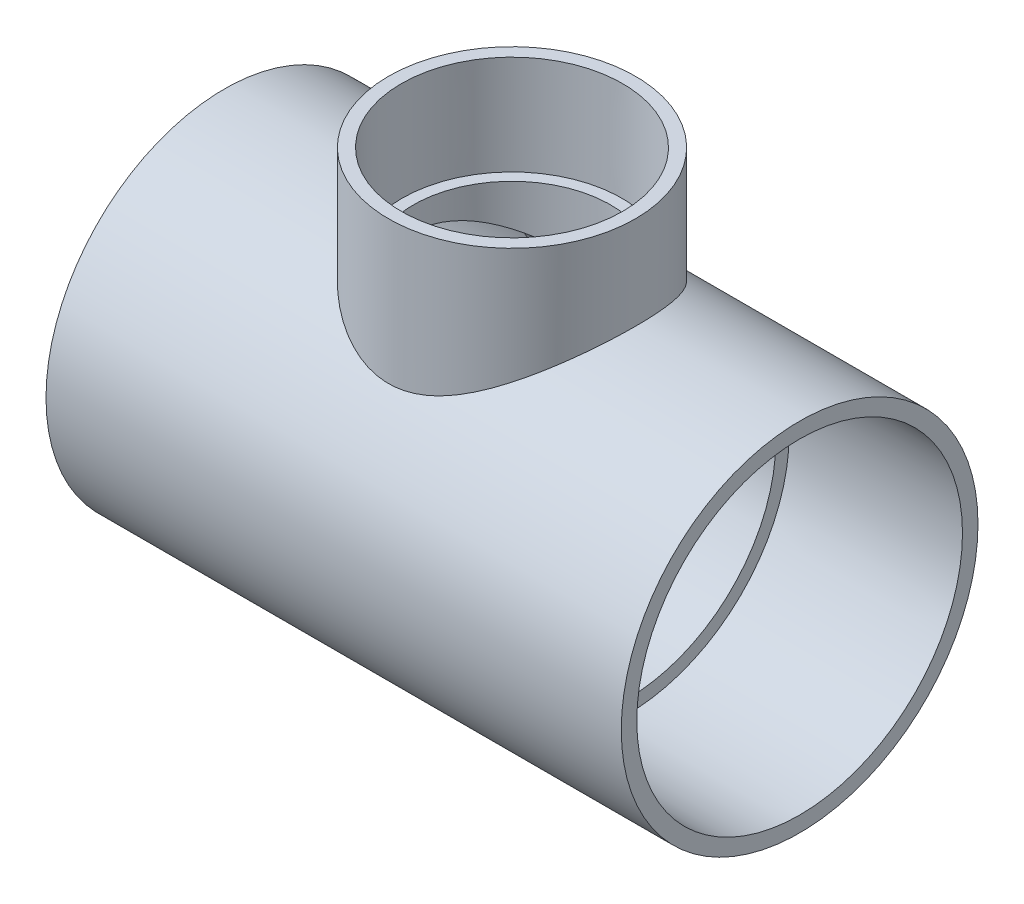
ISO-10303-21;
HEADER;
FILE_DESCRIPTION(('STEP AP214'),'2;1');
FILE_NAME('part.step','',(''),(''),'','','');
FILE_SCHEMA(('AUTOMOTIVE_DESIGN { 1 0 10303 214 1 1 1 1 }'));
ENDSEC;
DATA;
#1=APPLICATION_CONTEXT('core data for automotive mechanical design processes');
#2=APPLICATION_PROTOCOL_DEFINITION('international standard','automotive_design',2000,#1);
#3=PRODUCT_CONTEXT('',#1,'mechanical');
#4=PRODUCT('Part','Part','',(#3));
#5=PRODUCT_RELATED_PRODUCT_CATEGORY('part','',(#4));
#6=PRODUCT_DEFINITION_FORMATION('','',#4);
#7=PRODUCT_DEFINITION_CONTEXT('part definition',#1,'design');
#8=PRODUCT_DEFINITION('design','',#6,#7);
#9=PRODUCT_DEFINITION_SHAPE('','',#8);
#10=(LENGTH_UNIT() NAMED_UNIT(*) SI_UNIT(.MILLI.,.METRE.));
#11=(NAMED_UNIT(*) PLANE_ANGLE_UNIT() SI_UNIT($,.RADIAN.));
#12=(NAMED_UNIT(*) SI_UNIT($,.STERADIAN.) SOLID_ANGLE_UNIT());
#13=UNCERTAINTY_MEASURE_WITH_UNIT(LENGTH_MEASURE(1.E-05),#10,'distance_accuracy_value','');
#14=(GEOMETRIC_REPRESENTATION_CONTEXT(3) GLOBAL_UNCERTAINTY_ASSIGNED_CONTEXT((#13)) GLOBAL_UNIT_ASSIGNED_CONTEXT((#10,
#11,#12)) REPRESENTATION_CONTEXT('',''));
#15=CARTESIAN_POINT('',(0.,0.,0.));
#16=DIRECTION('',(0.,0.,1.));
#17=DIRECTION('',(1.,0.,0.));
#18=AXIS2_PLACEMENT_3D('',#15,#16,#17);
#19=CARTESIAN_POINT('',(-59.69,0.,0.));
#20=DIRECTION('',(1.,0.,0.));
#21=DIRECTION('',(0.,0.,-1.));
#22=AXIS2_PLACEMENT_3D('',#19,#20,#21);
#23=PLANE('',#22);
#24=CARTESIAN_POINT('',(-59.69,0.,0.));
#25=DIRECTION('',(-1.,0.,0.));
#26=DIRECTION('',(0.,0.,1.));
#27=AXIS2_PLACEMENT_3D('',#24,#25,#26);
#28=CIRCLE('',#27,83.9978);
#29=CARTESIAN_POINT('',(-59.69,0.,83.9978));
#30=VERTEX_POINT('',#29);
#31=EDGE_CURVE('E99',#30,#30,#28,.T.);
#32=ORIENTED_EDGE('',*,*,#31,.T.);
#33=EDGE_LOOP('',(#32));
#34=FACE_BOUND('',#33,.T.);
#35=CARTESIAN_POINT('',(-59.69,0.,0.));
#36=DIRECTION('',(1.,0.,0.));
#37=DIRECTION('',(0.,0.,-1.));
#38=AXIS2_PLACEMENT_3D('',#35,#36,#37);
#39=CIRCLE('',#38,77.0255);
#40=CARTESIAN_POINT('',(-59.69,0.,-77.0255));
#41=VERTEX_POINT('',#40);
#42=EDGE_CURVE('E102',#41,#41,#39,.T.);
#43=ORIENTED_EDGE('',*,*,#42,.T.);
#44=EDGE_LOOP('',(#43));
#45=FACE_BOUND('',#44,.T.);
#46=ADVANCED_FACE('F32',(#34,#45),#23,.F.);
#47=CARTESIAN_POINT('',(59.69,0.,0.));
#48=DIRECTION('',(1.,0.,0.));
#49=DIRECTION('',(0.,0.,-1.));
#50=AXIS2_PLACEMENT_3D('',#47,#48,#49);
#51=PLANE('',#50);
#52=CARTESIAN_POINT('',(59.69,0.,0.));
#53=DIRECTION('',(1.,0.,0.));
#54=DIRECTION('',(0.,0.,-1.));
#55=AXIS2_PLACEMENT_3D('',#52,#53,#54);
#56=CIRCLE('',#55,77.0255);
#57=CARTESIAN_POINT('',(59.69,0.,-77.0255));
#58=VERTEX_POINT('',#57);
#59=EDGE_CURVE('E105',#58,#58,#56,.T.);
#60=ORIENTED_EDGE('',*,*,#59,.F.);
#61=EDGE_LOOP('',(#60));
#62=FACE_BOUND('',#61,.T.);
#63=CARTESIAN_POINT('',(59.69,0.,0.));
#64=DIRECTION('',(1.,0.,0.));
#65=DIRECTION('',(0.,0.,-1.));
#66=AXIS2_PLACEMENT_3D('',#63,#64,#65);
#67=CIRCLE('',#66,83.9978);
#68=CARTESIAN_POINT('',(59.69,0.,-83.9978));
#69=VERTEX_POINT('',#68);
#70=EDGE_CURVE('E10',#69,#69,#67,.F.);
#71=ORIENTED_EDGE('',*,*,#70,.F.);
#72=EDGE_LOOP('',(#71));
#73=FACE_BOUND('',#72,.T.);
#74=ADVANCED_FACE('F74',(#62,#73),#51,.T.);
#75=CARTESIAN_POINT('',(59.69,0.,0.));
#76=DIRECTION('',(-1.,0.,0.));
#77=DIRECTION('',(0.,0.,1.));
#78=AXIS2_PLACEMENT_3D('',#75,#76,#77);
#79=CYLINDRICAL_SURFACE('',#78,92.456);
#80=CARTESIAN_POINT('',(-149.098,0.,0.));
#81=DIRECTION('',(-1.,0.,0.));
#82=DIRECTION('',(0.,0.,1.));
#83=AXIS2_PLACEMENT_3D('',#80,#81,#82);
#84=CIRCLE('',#83,92.456);
#85=CARTESIAN_POINT('',(-149.098,0.,92.456));
#86=VERTEX_POINT('',#85);
#87=EDGE_CURVE('E116',#86,#86,#84,.T.);
#88=ORIENTED_EDGE('',*,*,#87,.F.);
#89=EDGE_LOOP('',(#88));
#90=FACE_BOUND('',#89,.T.);
#91=CARTESIAN_POINT('',(149.098,0.,0.));
#92=DIRECTION('',(-1.,0.,0.));
#93=DIRECTION('',(0.,0.,1.));
#94=AXIS2_PLACEMENT_3D('',#91,#92,#93);
#95=CIRCLE('',#94,92.456);
#96=CARTESIAN_POINT('',(149.098,0.,92.456));
#97=VERTEX_POINT('',#96);
#98=EDGE_CURVE('E104',#97,#97,#95,.T.);
#99=ORIENTED_EDGE('',*,*,#98,.T.);
#100=EDGE_LOOP('',(#99));
#101=FACE_BOUND('',#100,.T.);
#102=CARTESIAN_POINT('',(59.69,89.5208577483482,-23.1112086226575));
#103=CARTESIAN_POINT('',(59.3554663387617,89.2977999864228,-23.9752190458187));
#104=CARTESIAN_POINT('',(59.0031074123157,89.0638956499389,-24.8295390852443));
#105=CARTESIAN_POINT('',(58.26403555565,88.5760050139357,-26.5174514416343));
#106=CARTESIAN_POINT('',(57.8773176495958,88.3220158063324,-27.351040733946));
#107=CARTESIAN_POINT('',(57.0706194898345,87.7955010413279,-28.9967010459885));
#108=CARTESIAN_POINT('',(56.6506178591822,87.5229635871771,-29.8087577819716));
#109=CARTESIAN_POINT('',(55.7788572080423,86.9612430102109,-31.4097801961228));
#110=CARTESIAN_POINT('',(55.3270943985306,86.6720579021228,-32.198743103303));
#111=CARTESIAN_POINT('',(53.9229938311503,85.7802556376608,-34.5346499151826));
#112=CARTESIAN_POINT('',(52.9243438206633,85.1550349066213,-36.0455299595556));
#113=CARTESIAN_POINT('',(50.813858099626,83.8596568386321,-38.9643475085655));
#114=CARTESIAN_POINT('',(49.7020451482914,83.1895085466855,-40.3723056152713));
#115=CARTESIAN_POINT('',(47.3806832688408,81.8238472929828,-43.072527990592));
#116=CARTESIAN_POINT('',(46.1718653514752,81.1285423858296,-44.3655266603224));
#117=CARTESIAN_POINT('',(43.655809691159,79.7234476283726,-46.8434918221617));
#118=CARTESIAN_POINT('',(42.3485638201298,79.0136565853544,-48.0284493744432));
#119=CARTESIAN_POINT('',(39.6411181758483,77.5962391482218,-50.2862916521847));
#120=CARTESIAN_POINT('',(38.2409757736595,76.8886116952772,-51.3592445149715));
#121=CARTESIAN_POINT('',(35.3505043579797,75.4926779572051,-53.3899335636718));
#122=CARTESIAN_POINT('',(33.8601867618232,74.8043692421651,-54.3476842899613));
#123=CARTESIAN_POINT('',(30.984331803503,73.5503846340758,-56.0304578391637));
#124=CARTESIAN_POINT('',(29.6090438539686,72.9801456957546,-56.7696052260947));
#125=CARTESIAN_POINT('',(26.7935782985449,71.8839536313517,-58.1514131749876));
#126=CARTESIAN_POINT('',(25.3534008887046,71.3580003714844,-58.7940740284365));
#127=CARTESIAN_POINT('',(22.4134119857637,70.3671558115938,-59.9764098853398));
#128=CARTESIAN_POINT('',(20.9136868170345,69.9021800426788,-60.5162278314716));
#129=CARTESIAN_POINT('',(17.8580526442485,69.0496075231491,-61.4872494797449));
#130=CARTESIAN_POINT('',(16.3021573262223,68.6619920717214,-61.9184794381799));
#131=CARTESIAN_POINT('',(13.4403927328667,68.0453102055292,-62.5948544851815));
#132=CARTESIAN_POINT('',(12.1426495834532,67.8001311985442,-62.8597520112977));
#133=CARTESIAN_POINT('',(9.52212873223079,67.3801710178434,-63.3097119517935));
#134=CARTESIAN_POINT('',(8.19935418177174,67.2053810433653,-63.4947843469392));
#135=CARTESIAN_POINT('',(5.53822260526522,66.932877858907,-63.7819819623347));
#136=CARTESIAN_POINT('',(4.19988251370853,66.8350876238845,-63.8841900771378));
#137=CARTESIAN_POINT('',(1.51589744611891,66.72022536874,-64.0041444786235));
#138=CARTESIAN_POINT('',(0.170252368713385,66.7031544716561,-64.0218895901827));
#139=CARTESIAN_POINT('',(-2.51875979197083,66.750459096728,-63.9725664205185));
#140=CARTESIAN_POINT('',(-3.86212523769395,66.8148789330069,-63.9054519932469));
#141=CARTESIAN_POINT('',(-6.53580579486743,67.0225913724504,-63.6875700974569));
#142=CARTESIAN_POINT('',(-7.86612098407086,67.165883505405,-63.5368031276466));
#143=CARTESIAN_POINT('',(-10.5064594434597,67.5259989366212,-63.1539406048978));
#144=CARTESIAN_POINT('',(-11.8164563008452,67.7429107233929,-62.9217471686863));
#145=CARTESIAN_POINT('',(-14.4074136415402,68.242540125223,-62.3795094150518));
#146=CARTESIAN_POINT('',(-15.6883702354653,68.5252664984066,-62.0694547359896));
#147=CARTESIAN_POINT('',(-18.590264837853,69.2399138788802,-61.2724353166537));
#148=CARTESIAN_POINT('',(-20.1995407728231,69.6912223453109,-60.7602719764554));
#149=CARTESIAN_POINT('',(-23.3525227788316,70.669504803955,-59.6196018302944));
#150=CARTESIAN_POINT('',(-24.8962081753497,71.1965024278969,-58.9910586703413));
#151=CARTESIAN_POINT('',(-27.9152323941623,72.3075035741706,-57.623897515403));
#152=CARTESIAN_POINT('',(-29.3904751438177,72.8915838536071,-56.8851305837498));
#153=CARTESIAN_POINT('',(-32.2674158074538,74.0983716021366,-55.3039987445553));
#154=CARTESIAN_POINT('',(-33.6691188976241,74.7210763458429,-54.4616411423792));
#155=CARTESIAN_POINT('',(-36.4280838800247,76.0037343697505,-52.6573571852428));
#156=CARTESIAN_POINT('',(-37.7836014823566,76.6642134029718,-51.6931407803076));
#157=CARTESIAN_POINT('',(-40.4130587434385,77.9936967036142,-49.6645357200113));
#158=CARTESIAN_POINT('',(-41.686995701166,78.6627012524252,-48.6001437508541));
#159=CARTESIAN_POINT('',(-44.1493131272083,79.9948652255017,-46.3747178899279));
#160=CARTESIAN_POINT('',(-45.3377396044791,80.6580276219993,-45.2137367042097));
#161=CARTESIAN_POINT('',(-47.6254436970386,81.9657865552406,-42.7973012767197));
#162=CARTESIAN_POINT('',(-48.7247249469364,82.6103838482248,-41.5418508906527));
#163=CARTESIAN_POINT('',(-50.7995845338728,83.8511405580784,-38.9752915638771));
#164=CARTESIAN_POINT('',(-51.7777420116761,84.4481463063878,-37.6666797734471));
#165=CARTESIAN_POINT('',(-53.6384817153447,85.6016455572665,-34.9660678761339));
#166=CARTESIAN_POINT('',(-54.5210629005335,86.1581386186942,-33.5740668615287));
#167=CARTESIAN_POINT('',(-56.1830797984639,87.2193648196669,-30.7119273073396));
#168=CARTESIAN_POINT('',(-56.9625708389603,87.7241256905067,-29.2418312795231));
#169=CARTESIAN_POINT('',(-58.4111151201601,88.6715627483233,-26.2289614358095));
#170=CARTESIAN_POINT('',(-59.0801819837558,89.1142465926504,-24.6861966152013));
#171=CARTESIAN_POINT('',(-60.2259582414038,89.8782210832087,-21.72697960313));
#172=CARTESIAN_POINT('',(-60.7161506561855,90.2077206453983,-20.3178603086698));
#173=CARTESIAN_POINT('',(-61.599729753784,90.804781929651,-17.4567562430098));
#174=CARTESIAN_POINT('',(-61.9931238874162,91.0723484187696,-16.004774780664));
#175=CARTESIAN_POINT('',(-62.6781740613817,91.5400389492652,-13.0669249337033));
#176=CARTESIAN_POINT('',(-62.9698727684976,91.7401912733666,-11.5810710398642));
#177=CARTESIAN_POINT('',(-63.4478550829534,92.0689309244302,-8.5846012989107));
#178=CARTESIAN_POINT('',(-63.6341377365908,92.1975176039354,-7.07398522789925));
#179=CARTESIAN_POINT('',(-63.8989529709849,92.3804895182398,-4.03488714552636));
#180=CARTESIAN_POINT('',(-63.9772062451495,92.434682408195,-2.50636908868671));
#181=CARTESIAN_POINT('',(-64.0238922256719,92.467001461198,0.553154747373212));
#182=CARTESIAN_POINT('',(-63.9923249101024,92.4451276090579,2.08416052709014));
#183=CARTESIAN_POINT('',(-63.8198363375468,92.3258118024288,5.13717545831421));
#184=CARTESIAN_POINT('',(-63.6789031187684,92.2283615818465,6.65918360736484));
#185=CARTESIAN_POINT('',(-63.2897360531864,91.9600930541029,9.68281513276673));
#186=CARTESIAN_POINT('',(-63.0415027881938,91.7892751447618,11.1844386196038));
#187=CARTESIAN_POINT('',(-62.4492163769531,91.3835177173027,14.1172861666169));
#188=CARTESIAN_POINT('',(-62.1078972337637,91.1504111134797,15.5493195200951));
#189=CARTESIAN_POINT('',(-61.3310534151464,90.6228708211983,18.3759176742353));
#190=CARTESIAN_POINT('',(-60.8955309098098,90.3284385454585,19.7704833371801));
#191=CARTESIAN_POINT('',(-59.9349862860816,89.6836870842967,22.5152396738962));
#192=CARTESIAN_POINT('',(-59.4099538066725,89.3333614293689,23.865425188942));
#193=CARTESIAN_POINT('',(-58.2754664792542,88.5829380934113,26.5155048160386));
#194=CARTESIAN_POINT('',(-57.6660069899738,88.1828376761983,27.8153961581997));
#195=CARTESIAN_POINT('',(-56.3067971239888,87.2997808145201,30.4796647849184));
#196=CARTESIAN_POINT('',(-55.5492497658111,86.8125727375233,31.8386539110354));
#197=CARTESIAN_POINT('',(-53.945477302325,85.7952102379854,34.4863112252674));
#198=CARTESIAN_POINT('',(-53.0992475416272,85.2650535611861,35.7749757162797));
#199=CARTESIAN_POINT('',(-51.3231691004812,84.1704580204781,38.2794310396203));
#200=CARTESIAN_POINT('',(-50.3932608277157,83.6059948192602,39.4951688932246));
#201=CARTESIAN_POINT('',(-48.4552781427792,82.4523839052352,41.8501604099012));
#202=CARTESIAN_POINT('',(-47.4471997210683,81.863234926947,42.9894101441094));
#203=CARTESIAN_POINT('',(-45.1748165015013,80.5657241684703,45.3809939226213));
#204=CARTESIAN_POINT('',(-43.8964690564179,79.8544747103552,46.6184523982376));
#205=CARTESIAN_POINT('',(-41.2427378202998,78.4270341135425,48.9818180440883));
#206=CARTESIAN_POINT('',(-39.8673372707892,77.7108421407618,50.1077058679584));
#207=CARTESIAN_POINT('',(-37.0230871554459,76.2907450461675,52.2444259513123));
#208=CARTESIAN_POINT('',(-35.5542086612206,75.5868438146674,53.2552223211456));
#209=CARTESIAN_POINT('',(-32.526588166316,74.2108410298406,55.1564991838276));
#210=CARTESIAN_POINT('',(-30.9678649299345,73.5387328894519,56.0470046707584));
#211=CARTESIAN_POINT('',(-28.0457860210703,72.3615598232684,57.555751393063));
#212=CARTESIAN_POINT('',(-26.6963645448734,71.8479215786282,58.1943226483861));
#213=CARTESIAN_POINT('',(-23.9407699143416,70.8702302952243,59.3810866420334));
#214=CARTESIAN_POINT('',(-22.5345990520069,70.4061752566445,59.9292830258894));
#215=CARTESIAN_POINT('',(-19.6717151349019,69.5428313049946,60.9289947473117));
#216=CARTESIAN_POINT('',(-18.2150934238472,69.1434320806358,61.3806751843003));
#217=CARTESIAN_POINT('',(-15.2550875291832,68.4232953662764,62.1824392291871));
#218=CARTESIAN_POINT('',(-13.7517122891122,68.1025429348691,62.5325421372192));
#219=CARTESIAN_POINT('',(-10.9430674509587,67.5961308388841,63.0792472426034));
#220=CARTESIAN_POINT('',(-9.64316924053322,67.3972433184131,63.2912239615251));
#221=CARTESIAN_POINT('',(-7.02377566323692,67.0725991759373,63.6351688956575));
#222=CARTESIAN_POINT('',(-5.70428250154615,66.9468343878434,63.7671460450082));
#223=CARTESIAN_POINT('',(-3.055330889708,66.7733298123732,63.948810006117));
#224=CARTESIAN_POINT('',(-1.72587932061167,66.7255403891269,63.9985491674223));
#225=CARTESIAN_POINT('',(0.934053289756203,66.7097565771038,64.0150019415726));
#226=CARTESIAN_POINT('',(2.26453435474056,66.741764084538,63.9817135814382));
#227=CARTESIAN_POINT('',(4.91479822330304,66.8841851245378,63.8328139280837));
#228=CARTESIAN_POINT('',(6.23459301370627,66.9944930930691,63.7173134719547));
#229=CARTESIAN_POINT('',(8.85621355716845,67.2891020758207,63.4061061368734));
#230=CARTESIAN_POINT('',(10.1580394250519,67.4734026169891,63.2103997706961));
#231=CARTESIAN_POINT('',(12.7376700944918,67.9096280729765,62.7415067036277));
#232=CARTESIAN_POINT('',(14.0154444255436,68.1616333036571,62.4682279592413));
#233=CARTESIAN_POINT('',(16.5395465442369,68.7250313532904,61.8478562094793));
#234=CARTESIAN_POINT('',(17.7858699763579,69.036432347194,61.500753042503));
#235=CARTESIAN_POINT('',(20.683814684731,69.830728845329,60.5991755011647));
#236=CARTESIAN_POINT('',(22.3203729892869,70.3350638559387,60.0149845268321));
#237=CARTESIAN_POINT('',(25.5207011970825,71.4151384908384,58.7256061669105));
#238=CARTESIAN_POINT('',(27.0844451623909,71.9909032962532,58.0203760776508));
#239=CARTESIAN_POINT('',(30.1370734696571,73.1939915044692,56.4950991527124));
#240=CARTESIAN_POINT('',(31.6258466908258,73.8213880082653,55.6748883290961));
#241=CARTESIAN_POINT('',(34.523302593221,75.1083317905249,53.926144079416));
#242=CARTESIAN_POINT('',(35.9319922407525,75.7678762632038,52.9976200968012));
#243=CARTESIAN_POINT('',(38.6976703845909,77.1174968776912,51.0144519498477));
#244=CARTESIAN_POINT('',(40.0527933785384,77.8079260007436,49.9574481682455));
#245=CARTESIAN_POINT('',(42.673777691236,79.1890072465014,47.7380517027536));
#246=CARTESIAN_POINT('',(43.9396352614759,79.8796593773495,46.5756545977767));
#247=CARTESIAN_POINT('',(46.3768218174502,81.2458007656194,44.1493906691446));
#248=CARTESIAN_POINT('',(47.5482210054017,81.9213010094225,42.885600621487));
#249=CARTESIAN_POINT('',(49.7918820326032,83.2436079374658,40.258855577447));
#250=CARTESIAN_POINT('',(50.8641503916193,83.8904165072799,38.895907113196));
#251=CARTESIAN_POINT('',(52.8407877277969,85.1038533788474,36.1600270419427));
#252=CARTESIAN_POINT('',(53.7513945981831,85.6729653351185,34.7927100229949));
#253=CARTESIAN_POINT('',(55.4721462820419,86.7629165758382,31.9779000804274));
#254=CARTESIAN_POINT('',(56.2822948320487,87.2837576555337,30.5304101417281));
#255=CARTESIAN_POINT('',(57.7944478299843,88.2663910326196,27.5608373976906));
#256=CARTESIAN_POINT('',(58.4964809819213,88.7281989974051,26.0387745329751));
#257=CARTESIAN_POINT('',(59.4623706299638,89.3689190030956,23.7056943386896));
#258=CARTESIAN_POINT('',(59.7698460562192,89.5738533851768,22.9195504068006));
#259=CARTESIAN_POINT('',(60.354777972653,89.9652141909304,21.3316750902643));
#260=CARTESIAN_POINT('',(60.6322378338672,90.1516426927964,20.5299454679956));
#261=CARTESIAN_POINT('',(61.1581262613215,90.5061671927235,18.9061231863044));
#262=CARTESIAN_POINT('',(61.406322660074,90.6741159579108,18.0839231974439));
#263=CARTESIAN_POINT('',(61.8702927369785,90.9889661247029,16.4265440881315));
#264=CARTESIAN_POINT('',(62.0860703424854,91.1358700756682,15.5913665533845));
#265=CARTESIAN_POINT('',(62.484376437842,91.4076800679971,13.9094816541103));
#266=CARTESIAN_POINT('',(62.6669016314913,91.5325839285247,13.0627731554883));
#267=CARTESIAN_POINT('',(62.9978906888644,91.7595095095671,11.3596801832324));
#268=CARTESIAN_POINT('',(63.1463546606409,91.8615313026709,10.5032957403026));
#269=CARTESIAN_POINT('',(63.4085180820853,92.0419414838107,8.78298023850757));
#270=CARTESIAN_POINT('',(63.522226801778,92.1203361736605,7.91905125528919));
#271=CARTESIAN_POINT('',(63.7144033047439,92.2529577950264,6.18542374862218));
#272=CARTESIAN_POINT('',(63.7928707992452,92.3071845285065,5.31572517795596));
#273=CARTESIAN_POINT('',(63.9141790298195,92.3910614405496,3.57278875701442));
#274=CARTESIAN_POINT('',(63.9570248057869,92.420715095802,2.69955142499016));
#275=CARTESIAN_POINT('',(64.0068977630762,92.4552351173357,0.951582206292259));
#276=CARTESIAN_POINT('',(64.0139261290647,92.4601023034336,0.076850370006871));
#277=CARTESIAN_POINT('',(63.9935261638878,92.4459801322149,-1.56037185898708));
#278=CARTESIAN_POINT('',(63.970378955807,92.429954849911,-2.32294588165685));
#279=CARTESIAN_POINT('',(63.8968866373954,92.3791063410444,-3.84622308353524));
#280=CARTESIAN_POINT('',(63.8465391949756,92.3442815026489,-4.6069260967089));
#281=CARTESIAN_POINT('',(63.7188305582862,92.2560301121719,-6.1249281571982));
#282=CARTESIAN_POINT('',(63.6414713808815,92.2026049489077,-6.88222745438171));
#283=CARTESIAN_POINT('',(63.4600257621432,92.0774592577576,-8.39211966925378));
#284=CARTESIAN_POINT('',(63.355936833218,92.0057370270678,-9.14471214222278));
#285=CARTESIAN_POINT('',(63.0044798939429,91.7639520797472,-11.3909022501));
#286=CARTESIAN_POINT('',(62.7176851838194,91.5671067016522,-12.8757042651209));
#287=CARTESIAN_POINT('',(62.0428437349938,91.10621117485,-15.8106457961657));
#288=CARTESIAN_POINT('',(61.6548403170305,90.8421897809276,-17.2607998534852));
#289=CARTESIAN_POINT('',(60.9898707385302,90.3926105113727,-19.4389894643457));
#290=CARTESIAN_POINT('',(60.747814528654,90.2294254845745,-20.1825618413042));
#291=CARTESIAN_POINT('',(60.238001800017,89.8869792120305,-21.6567558345627));
#292=CARTESIAN_POINT('',(59.9702560292323,89.7077246914692,-22.3873827167257));
#293=CARTESIAN_POINT('',(59.69,89.5208577483482,-23.1112086226575));
#294=B_SPLINE_CURVE_WITH_KNOTS('',3,(#102,#103,#104,#105,#106,#107,#108,#109,#110,#111,#112,
#113,#114,#115,#116,#117,#118,#119,#120,#121,#122,#123,#124,#125,#126,#127,#128,#129,#130,#131,
#132,#133,#134,#135,#136,#137,#138,#139,#140,#141,#142,#143,#144,#145,#146,#147,#148,#149,#150,
#151,#152,#153,#154,#155,#156,#157,#158,#159,#160,#161,#162,#163,#164,#165,#166,#167,#168,#169,
#170,#171,#172,#173,#174,#175,#176,#177,#178,#179,#180,#181,#182,#183,#184,#185,#186,#187,#188,
#189,#190,#191,#192,#193,#194,#195,#196,#197,#198,#199,#200,#201,#202,#203,#204,#205,#206,#207,
#208,#209,#210,#211,#212,#213,#214,#215,#216,#217,#218,#219,#220,#221,#222,#223,#224,#225,#226,
#227,#228,#229,#230,#231,#232,#233,#234,#235,#236,#237,#238,#239,#240,#241,#242,#243,#244,#245,
#246,#247,#248,#249,#250,#251,#252,#253,#254,#255,#256,#257,#258,#259,#260,#261,#262,#263,#264,
#265,#266,#267,#268,#269,#270,#271,#272,#273,#274,#275,#276,#277,#278,#279,#280,#281,#282,#283,
#284,#285,#286,#287,#288,#289,#290,#291,#292,#293),.UNSPECIFIED.,.T.,.F.,(4,2,2,2,2,2,2,2,2,2,2,
2,2,2,2,2,2,2,2,2,2,2,2,2,2,2,2,2,2,2,2,2,2,2,2,2,2,2,2,2,2,2,2,2,2,2,2,2,2,2,2,2,2,2,2,2,2,2,2,
2,2,2,2,2,2,2,2,2,2,2,2,2,2,2,2,2,2,2,2,2,2,2,2,2,2,2,2,2,2,2,2,2,2,2,2,4),(0.,2.85871127809711,
5.71783722892731,8.57881461295993,11.4401338850378,17.1804021320638,22.9195181748721,
28.6188466365329,34.318646260117,40.0149579888676,45.7105499946817,50.6929030230498,
55.6752409993694,60.6506026142082,65.6247600418299,69.6617091014858,73.6981532633452,
77.7305545067021,81.7630118521949,85.7976629643336,89.8322900235102,93.8717838536415,
97.9118155377489,103.14831706495,108.386457105391,113.631740228364,118.87665365821,
124.24126576111,129.606055387176,134.967936559517,140.329599008414,145.543081317949,
150.756620388456,155.967349935162,161.177436159395,165.756488558504,170.335188385713,
174.911964880047,179.488782779969,184.07741187741,188.666041891039,193.255173852489,
197.844280930688,202.310915682658,206.777447551122,211.244496783997,215.711791684943,
220.59811695125,225.484698854183,230.374788740877,235.26512961848,241.007429783981,
246.750723929056,252.495804162845,258.239688839625,262.972066804978,267.704253829453,
272.428280035689,277.151408069492,281.143171570156,285.134489199077,289.123265128797,
293.112135844529,297.095638986787,301.079116661982,305.067340832655,309.056114320184,
314.476347995163,319.898497922373,325.328461235073,330.757951481429,336.309089379534,
341.860460247132,347.407666518396,352.954507693797,358.165071875611,363.375442192988,
368.584426793729,371.189687155741,373.794654617603,376.419067147024,379.043161486805,
381.667515802924,384.291861793663,386.915507198923,389.539174102334,392.162469736312,
394.785678603806,397.074255751157,399.363029147284,401.651631685829,403.94044728932,
408.509686725154,413.076973572709,415.472860884299,417.867750141648),.UNSPECIFIED.);
#295=CARTESIAN_POINT('',(59.69,89.5208577483482,-23.1112086226575));
#296=VERTEX_POINT('',#295);
#297=EDGE_CURVE('E57',#296,#296,#294,.T.);
#298=ORIENTED_EDGE('',*,*,#297,.F.);
#299=EDGE_LOOP('',(#298));
#300=FACE_BOUND('',#299,.T.);
#301=ADVANCED_FACE('F69',(#90,#101,#300),#79,.T.);
#302=CARTESIAN_POINT('',(-59.69,0.,0.));
#303=DIRECTION('',(-1.,0.,0.));
#304=DIRECTION('',(0.,0.,1.));
#305=AXIS2_PLACEMENT_3D('',#302,#303,#304);
#306=CONICAL_SURFACE('',#305,83.9978,0.00468746566817729);
#307=CARTESIAN_POINT('',(-149.098,0.,0.));
#308=DIRECTION('',(-1.,0.,0.));
#309=DIRECTION('',(0.,0.,1.));
#310=AXIS2_PLACEMENT_3D('',#307,#308,#309);
#311=CIRCLE('',#310,84.4169);
#312=CARTESIAN_POINT('',(-149.098,0.,84.4169));
#313=VERTEX_POINT('',#312);
#314=EDGE_CURVE('E64',#313,#313,#311,.T.);
#315=ORIENTED_EDGE('',*,*,#314,.T.);
#316=EDGE_LOOP('',(#315));
#317=FACE_BOUND('',#316,.T.);
#318=ORIENTED_EDGE('',*,*,#31,.F.);
#319=EDGE_LOOP('',(#318));
#320=FACE_BOUND('',#319,.T.);
#321=ADVANCED_FACE('F73',(#317,#320),#306,.F.);
#322=CARTESIAN_POINT('',(149.098,0.,0.));
#323=DIRECTION('',(1.,0.,0.));
#324=DIRECTION('',(0.,0.,-1.));
#325=AXIS2_PLACEMENT_3D('',#322,#323,#324);
#326=CONICAL_SURFACE('',#325,84.4169,0.00468746566817698);
#327=CARTESIAN_POINT('',(149.098,0.,0.));
#328=DIRECTION('',(-1.,0.,0.));
#329=DIRECTION('',(0.,0.,1.));
#330=AXIS2_PLACEMENT_3D('',#327,#328,#329);
#331=CIRCLE('',#330,84.4169);
#332=CARTESIAN_POINT('',(149.098,0.,84.4169));
#333=VERTEX_POINT('',#332);
#334=EDGE_CURVE('E108',#333,#333,#331,.T.);
#335=ORIENTED_EDGE('',*,*,#334,.F.);
#336=EDGE_LOOP('',(#335));
#337=FACE_BOUND('',#336,.T.);
#338=ORIENTED_EDGE('',*,*,#70,.T.);
#339=EDGE_LOOP('',(#338));
#340=FACE_BOUND('',#339,.T.);
#341=ADVANCED_FACE('F86',(#337,#340),#326,.F.);
#342=CARTESIAN_POINT('',(0.,0.,0.));
#343=DIRECTION('',(0.,-1.,0.));
#344=DIRECTION('',(1.,0.,0.));
#345=AXIS2_PLACEMENT_3D('',#342,#343,#344);
#346=CYLINDRICAL_SURFACE('',#345,64.008);
#347=ORIENTED_EDGE('',*,*,#297,.T.);
#348=EDGE_LOOP('',(#347));
#349=FACE_BOUND('',#348,.T.);
#350=CARTESIAN_POINT('',(0.,140.716,0.));
#351=DIRECTION('',(0.,-1.,0.));
#352=DIRECTION('',(1.,0.,0.));
#353=AXIS2_PLACEMENT_3D('',#350,#351,#352);
#354=CIRCLE('',#353,64.008);
#355=CARTESIAN_POINT('',(64.008,140.716,0.));
#356=VERTEX_POINT('',#355);
#357=EDGE_CURVE('E45',#356,#356,#354,.T.);
#358=ORIENTED_EDGE('',*,*,#357,.T.);
#359=EDGE_LOOP('',(#358));
#360=FACE_BOUND('',#359,.T.);
#361=ADVANCED_FACE('F66',(#349,#360),#346,.T.);
#362=CARTESIAN_POINT('',(0.,140.716,0.));
#363=DIRECTION('',(0.,1.,0.));
#364=DIRECTION('',(-1.,0.,0.));
#365=AXIS2_PLACEMENT_3D('',#362,#363,#364);
#366=CONICAL_SURFACE('',#365,57.3786,0.00668306881884247);
#367=CARTESIAN_POINT('',(0.,140.716,0.));
#368=DIRECTION('',(0.,-1.,0.));
#369=DIRECTION('',(1.,0.,0.));
#370=AXIS2_PLACEMENT_3D('',#367,#368,#369);
#371=CIRCLE('',#370,57.3786);
#372=CARTESIAN_POINT('',(57.3786,140.716,0.));
#373=VERTEX_POINT('',#372);
#374=EDGE_CURVE('E54',#373,#373,#371,.T.);
#375=ORIENTED_EDGE('',*,*,#374,.F.);
#376=EDGE_LOOP('',(#375));
#377=FACE_BOUND('',#376,.T.);
#378=CARTESIAN_POINT('',(0.,89.408,0.));
#379=DIRECTION('',(0.,-1.,0.));
#380=DIRECTION('',(1.,0.,0.));
#381=AXIS2_PLACEMENT_3D('',#378,#379,#380);
#382=CIRCLE('',#381,57.0357);
#383=CARTESIAN_POINT('',(57.0357,89.408,0.));
#384=VERTEX_POINT('',#383);
#385=EDGE_CURVE('E49',#384,#384,#382,.T.);
#386=ORIENTED_EDGE('',*,*,#385,.T.);
#387=EDGE_LOOP('',(#386));
#388=FACE_BOUND('',#387,.T.);
#389=ADVANCED_FACE('F77',(#377,#388),#366,.F.);
#390=CARTESIAN_POINT('',(64.008,140.716,0.));
#391=DIRECTION('',(0.,1.,0.));
#392=DIRECTION('',(-1.,0.,0.));
#393=AXIS2_PLACEMENT_3D('',#390,#391,#392);
#394=PLANE('',#393);
#395=ORIENTED_EDGE('',*,*,#374,.T.);
#396=EDGE_LOOP('',(#395));
#397=FACE_BOUND('',#396,.T.);
#398=ORIENTED_EDGE('',*,*,#357,.F.);
#399=EDGE_LOOP('',(#398));
#400=FACE_BOUND('',#399,.T.);
#401=ADVANCED_FACE('F34',(#397,#400),#394,.T.);
#402=CARTESIAN_POINT('',(-149.098,-92.456,0.));
#403=DIRECTION('',(-1.,0.,0.));
#404=DIRECTION('',(0.,0.,1.));
#405=AXIS2_PLACEMENT_3D('',#402,#403,#404);
#406=PLANE('',#405);
#407=ORIENTED_EDGE('',*,*,#87,.T.);
#408=EDGE_LOOP('',(#407));
#409=FACE_BOUND('',#408,.T.);
#410=ORIENTED_EDGE('',*,*,#314,.F.);
#411=EDGE_LOOP('',(#410));
#412=FACE_BOUND('',#411,.T.);
#413=ADVANCED_FACE('F84',(#409,#412),#406,.T.);
#414=CARTESIAN_POINT('',(149.098,-92.456,0.));
#415=DIRECTION('',(1.,0.,0.));
#416=DIRECTION('',(0.,0.,-1.));
#417=AXIS2_PLACEMENT_3D('',#414,#415,#416);
#418=PLANE('',#417);
#419=ORIENTED_EDGE('',*,*,#334,.T.);
#420=EDGE_LOOP('',(#419));
#421=FACE_BOUND('',#420,.T.);
#422=ORIENTED_EDGE('',*,*,#98,.F.);
#423=EDGE_LOOP('',(#422));
#424=FACE_BOUND('',#423,.T.);
#425=ADVANCED_FACE('F124',(#421,#424),#418,.T.);
#426=CARTESIAN_POINT('',(0.,89.408,0.));
#427=DIRECTION('',(0.,-1.,0.));
#428=DIRECTION('',(1.,0.,0.));
#429=AXIS2_PLACEMENT_3D('',#426,#427,#428);
#430=PLANE('',#429);
#431=CARTESIAN_POINT('',(0.,89.408,0.));
#432=DIRECTION('',(0.,-1.,0.));
#433=DIRECTION('',(1.,0.,0.));
#434=AXIS2_PLACEMENT_3D('',#431,#432,#433);
#435=CIRCLE('',#434,51.1302);
#436=CARTESIAN_POINT('',(51.1302,89.408,0.));
#437=VERTEX_POINT('',#436);
#438=EDGE_CURVE('E156',#437,#437,#435,.T.);
#439=ORIENTED_EDGE('',*,*,#438,.T.);
#440=EDGE_LOOP('',(#439));
#441=FACE_BOUND('',#440,.T.);
#442=ORIENTED_EDGE('',*,*,#385,.F.);
#443=EDGE_LOOP('',(#442));
#444=FACE_BOUND('',#443,.T.);
#445=ADVANCED_FACE('F130',(#441,#444),#430,.F.);
#446=CARTESIAN_POINT('',(149.098,0.,0.));
#447=DIRECTION('',(1.,0.,0.));
#448=DIRECTION('',(0.,0.,-1.));
#449=AXIS2_PLACEMENT_3D('',#446,#447,#448);
#450=CYLINDRICAL_SURFACE('',#449,77.0255);
#451=CARTESIAN_POINT('',(51.1302,77.0255,0.));
#452=CARTESIAN_POINT('',(51.130197658186,77.0254978708211,1.28554064006303));
#453=CARTESIAN_POINT('',(51.081651407444,76.9932472256396,2.57111208865313));
#454=CARTESIAN_POINT('',(50.88822147382,76.8650517649064,5.13177261453875));
#455=CARTESIAN_POINT('',(50.7433350689223,76.7691051496749,6.40686139462411));
#456=CARTESIAN_POINT('',(50.3593454274752,76.5158360429261,8.93710826814995));
#457=CARTESIAN_POINT('',(50.1202007019975,76.3584865244891,10.1922573314535));
#458=CARTESIAN_POINT('',(49.5511086764608,75.9861592825056,12.67298911262));
#459=CARTESIAN_POINT('',(49.2211607866579,75.771181184676,13.8985716383993));
#460=CARTESIAN_POINT('',(48.476538371605,75.2896066173672,16.3065441837121));
#461=CARTESIAN_POINT('',(48.0622763437705,75.0232617744271,17.4891126484031));
#462=CARTESIAN_POINT('',(47.1527904272092,74.4438922529453,19.8107595760212));
#463=CARTESIAN_POINT('',(46.6575668548841,74.1308677568304,20.9498382088872));
#464=CARTESIAN_POINT('',(45.591031258546,73.464271210213,23.1793534260522));
#465=CARTESIAN_POINT('',(45.0197194933988,73.1106992976608,24.2697901758227));
#466=CARTESIAN_POINT('',(43.8057365600874,72.3694809192677,26.3980276681934));
#467=CARTESIAN_POINT('',(43.1630619461074,71.9818328082171,27.4358258655686));
#468=CARTESIAN_POINT('',(41.7536002864488,71.1452386207274,29.5410153721211));
#469=CARTESIAN_POINT('',(40.9809147018888,70.6938807423354,30.6034981402935));
#470=CARTESIAN_POINT('',(39.3617824448467,69.7677516618406,32.6597646856019));
#471=CARTESIAN_POINT('',(38.5153324320484,69.2929793998742,33.6535453480038));
#472=CARTESIAN_POINT('',(36.7517294182773,68.3284280596121,35.571152640891));
#473=CARTESIAN_POINT('',(35.8344840212048,67.8386298905055,36.4948846247725));
#474=CARTESIAN_POINT('',(33.9337444847441,66.8540829847831,38.2686338807542));
#475=CARTESIAN_POINT('',(32.9502464330935,66.3593339572873,39.1186467929038));
#476=CARTESIAN_POINT('',(30.7610009083046,65.2978905580383,40.8695255782795));
#477=CARTESIAN_POINT('',(29.5445451357415,64.7320403469978,41.7575673271358));
#478=CARTESIAN_POINT('',(27.0301838403467,63.6237976656751,43.427463338828));
#479=CARTESIAN_POINT('',(25.7322601456774,63.0814104748401,44.2092937867459));
#480=CARTESIAN_POINT('',(23.0605999529236,62.0395885086005,45.6597565907499));
#481=CARTESIAN_POINT('',(21.6869699273897,61.5400958160483,46.3285428027711));
#482=CARTESIAN_POINT('',(18.8673677306501,60.6039809669528,47.5465609648111));
#483=CARTESIAN_POINT('',(17.4214303947487,60.1673289216312,48.0958498151676));
#484=CARTESIAN_POINT('',(14.8890317268416,59.4918557820984,48.9269420828382));
#485=CARTESIAN_POINT('',(13.81838983766,59.2322113141462,49.2402807384021));
#486=CARTESIAN_POINT('',(11.648406366469,58.763885661445,49.7982556980304));
#487=CARTESIAN_POINT('',(10.5490694993272,58.5551961619164,50.0429032120234));
#488=CARTESIAN_POINT('',(8.3289750363041,58.1962567392855,50.459877076916));
#489=CARTESIAN_POINT('',(7.20825117327598,58.0459216687286,50.6323088301825));
#490=CARTESIAN_POINT('',(4.9510649665961,57.8090314507753,50.9026134338953));
#491=CARTESIAN_POINT('',(3.81460252650571,57.722476694371,51.0004858272708));
#492=CARTESIAN_POINT('',(1.52991768502745,57.6165239524866,51.1201562193852));
#493=CARTESIAN_POINT('',(0.381666372094254,57.5973973926233,51.1416467532427));
#494=CARTESIAN_POINT('',(-1.91275359592828,57.6278837783352,51.1072905521066));
#495=CARTESIAN_POINT('',(-3.05892224337681,57.6774969755924,51.0514435339514));
#496=CARTESIAN_POINT('',(-5.34089523039949,57.8434021084363,50.8633859834185));
#497=CARTESIAN_POINT('',(-6.47669124996291,57.959743484907,50.7311188285638));
#498=CARTESIAN_POINT('',(-8.72893468185402,58.2544219732675,50.3924607569872));
#499=CARTESIAN_POINT('',(-9.84538172001703,58.4327602826339,50.1860684085279));
#500=CARTESIAN_POINT('',(-12.0048772740299,58.8359606529689,49.7126698490226));
#501=CARTESIAN_POINT('',(-13.0490203758447,59.0585000380206,49.4486420347052));
#502=CARTESIAN_POINT('',(-15.1093999083625,59.5476457787663,48.8584928820516));
#503=CARTESIAN_POINT('',(-16.1256253503662,59.8142692046312,48.5323474831556));
#504=CARTESIAN_POINT('',(-18.126583655093,60.3844621302818,47.8210415929284));
#505=CARTESIAN_POINT('',(-19.1113132138881,60.6880354901802,47.4358749346305));
#506=CARTESIAN_POINT('',(-21.0466124176894,61.3249973543546,46.6094886784612));
#507=CARTESIAN_POINT('',(-21.9971896471089,61.6583791807925,46.1682816257639));
#508=CARTESIAN_POINT('',(-24.0519123755119,62.4182505215197,45.1373280521806));
#509=CARTESIAN_POINT('',(-25.1481421222816,62.8499174937176,44.5355989354537));
#510=CARTESIAN_POINT('',(-27.2870094434275,63.7358886321759,43.258161027907));
#511=CARTESIAN_POINT('',(-28.3296418951245,64.1901949540998,42.5824451848906));
#512=CARTESIAN_POINT('',(-30.3604616220468,65.1119683796687,41.1591881817508));
#513=CARTESIAN_POINT('',(-31.3485878006356,65.5794493987505,40.4115688991368));
#514=CARTESIAN_POINT('',(-33.2670789643811,66.5178843531632,38.8475316300381));
#515=CARTESIAN_POINT('',(-34.1974401384746,66.9888385153474,38.0311091125986));
#516=CARTESIAN_POINT('',(-36.1889097968728,68.0249856356745,36.1512340042443));
#517=CARTESIAN_POINT('',(-37.2359154163592,68.5889877990397,35.0721070163475));
#518=CARTESIAN_POINT('',(-39.2360160537307,69.6950586262211,32.8192260491546));
#519=CARTESIAN_POINT('',(-40.1890939468985,70.237123279856,31.6454548851833));
#520=CARTESIAN_POINT('',(-41.9935892759537,71.2850114342046,29.208435607026));
#521=CARTESIAN_POINT('',(-42.8450827527765,71.7908619281132,27.9452555627582));
#522=CARTESIAN_POINT('',(-44.438871726979,72.7532832402178,25.3342029486845));
#523=CARTESIAN_POINT('',(-45.181197355683,73.2098676470045,23.9863538954335));
#524=CARTESIAN_POINT('',(-46.4132539884405,73.9772699348791,21.4860334054139));
#525=CARTESIAN_POINT('',(-46.9239547575709,74.2990992812653,20.3472326638744));
#526=CARTESIAN_POINT('',(-47.8641087184356,74.896403902972,18.0247940060989));
#527=CARTESIAN_POINT('',(-48.2935714826223,75.1718846392274,16.8411613922524));
#528=CARTESIAN_POINT('',(-49.0661696040982,75.6705509604272,14.4361502681511));
#529=CARTESIAN_POINT('',(-49.4093627809853,75.8937715642303,13.2147976583449));
#530=CARTESIAN_POINT('',(-50.0054175267695,76.2831640616401,10.7412217212837));
#531=CARTESIAN_POINT('',(-50.2582776722466,76.4493350562875,9.48899790790887));
#532=CARTESIAN_POINT('',(-50.6709603729648,76.7212635728229,6.95722792781395));
#533=CARTESIAN_POINT('',(-50.8303817604131,76.8267605625715,5.67758805094725));
#534=CARTESIAN_POINT('',(-51.0520703150223,76.9736140590265,3.10622474629007));
#535=CARTESIAN_POINT('',(-51.1143373678436,77.0149704902468,1.81450130428041));
#536=CARTESIAN_POINT('',(-51.1407317467476,77.032490873053,-0.770351633629906));
#537=CARTESIAN_POINT('',(-51.1048618587643,77.0086566752856,-2.06348108857462));
#538=CARTESIAN_POINT('',(-50.9355547648734,76.8964043771936,-4.64045681713197));
#539=CARTESIAN_POINT('',(-50.8021215255517,76.8079889025189,-5.92430346600819));
#540=CARTESIAN_POINT('',(-50.4521916006153,76.5770071351028,-8.38517527976624));
#541=CARTESIAN_POINT('',(-50.2420074813053,76.4385628296636,-9.56349589027882));
#542=CARTESIAN_POINT('',(-49.7414703121387,76.1105014890432,-11.8956181756295));
#543=CARTESIAN_POINT('',(-49.4511216591873,75.9208872604689,-13.0494211914843));
#544=CARTESIAN_POINT('',(-48.7936103874809,75.4942657717915,-15.3259560470154));
#545=CARTESIAN_POINT('',(-48.4264428076829,75.2572554508451,-16.4486858746494));
#546=CARTESIAN_POINT('',(-47.6191327843871,74.7403238084751,-18.6573936184052));
#547=CARTESIAN_POINT('',(-47.1789864371681,74.4604001916287,-19.7433695647744));
#548=CARTESIAN_POINT('',(-46.2002440776513,73.8440210226253,-21.9401280518675));
#549=CARTESIAN_POINT('',(-45.6572293902563,73.5051331765984,-23.0482572354834));
#550=CARTESIAN_POINT('',(-44.4982370371181,72.7908999875889,-25.2133349620571));
#551=CARTESIAN_POINT('',(-43.882257094048,72.4155535067576,-26.2702819061089));
#552=CARTESIAN_POINT('',(-42.5815524883097,71.6348250428926,-28.3300756121932));
#553=CARTESIAN_POINT('',(-41.8967940013599,71.2294283075138,-29.3328953788961));
#554=CARTESIAN_POINT('',(-40.4628892323725,70.3955645969984,-31.2812282708388));
#555=CARTESIAN_POINT('',(-39.7137393872398,69.9670963456905,-32.2267382198977));
#556=CARTESIAN_POINT('',(-38.0315568702048,69.025140058039,-34.2028813489768));
#557=CARTESIAN_POINT('',(-37.0881621645001,68.5089053251875,-35.2234021069215));
#558=CARTESIAN_POINT('',(-35.1244377276879,67.4660216871379,-37.1819141694537));
#559=CARTESIAN_POINT('',(-34.1040976954418,66.939371394533,-38.1198943872842));
#560=CARTESIAN_POINT('',(-31.9895971839886,65.8871985948123,-39.9109514763169));
#561=CARTESIAN_POINT('',(-30.8953899342811,65.3616770237877,-40.763973692451));
#562=CARTESIAN_POINT('',(-28.6368375809084,64.3248963206183,-42.3811000960015));
#563=CARTESIAN_POINT('',(-27.4725001040226,63.8136356463932,-43.1452139259509));
#564=CARTESIAN_POINT('',(-25.1855841866798,62.8646383807561,-44.5151064891361));
#565=CARTESIAN_POINT('',(-24.068866911039,62.424447073787,-45.1289682699574));
#566=CARTESIAN_POINT('',(-21.7819336164344,61.5788476483286,-46.2761382567202));
#567=CARTESIAN_POINT('',(-20.6117171716497,61.1734398067685,-46.8094458213536));
#568=CARTESIAN_POINT('',(-18.2227748619271,60.4104364291842,-47.7900871617565));
#569=CARTESIAN_POINT('',(-17.0041235043342,60.052770884293,-48.237547254391));
#570=CARTESIAN_POINT('',(-14.5215885975577,59.3976025591402,-49.0420440539522));
#571=CARTESIAN_POINT('',(-13.2577151246619,59.1000864735626,-49.3991007629108));
#572=CARTESIAN_POINT('',(-10.9161685830326,58.6235298481854,-49.9631947810608));
#573=CARTESIAN_POINT('',(-9.84453726007468,58.4328719947575,-50.1855428216567));
#574=CARTESIAN_POINT('',(-7.68094113384815,58.1075226574424,-50.5618989093635));
#575=CARTESIAN_POINT('',(-6.58897875650184,57.9728245405324,-50.7159150561417));
#576=CARTESIAN_POINT('',(-4.39252702570503,57.7644411119244,-50.9531359869943));
#577=CARTESIAN_POINT('',(-3.28804948109529,57.6907024678891,-51.0364026702682));
#578=CARTESIAN_POINT('',(-1.07355345954953,57.6069331239027,-51.1309396067297));
#579=CARTESIAN_POINT('',(0.0364651049801115,57.5969034342884,-51.1422087181345));
#580=CARTESIAN_POINT('',(2.25394792718945,57.640968745463,-51.092537901858));
#581=CARTESIAN_POINT('',(3.36141124967504,57.6950843486663,-51.0315747743708));
#582=CARTESIAN_POINT('',(5.56522599033998,57.8653156409217,-50.8384628016751));
#583=CARTESIAN_POINT('',(6.66157750029451,57.9814308174781,-50.7063145448909));
#584=CARTESIAN_POINT('',(8.83714717066169,58.2714472415455,-50.3727581831678));
#585=CARTESIAN_POINT('',(9.91634449633959,58.4454138564074,-50.1712717227644));
#586=CARTESIAN_POINT('',(12.0504116559501,58.8450783777595,-49.7019030162066));
#587=CARTESIAN_POINT('',(13.1052783357876,59.0707829502583,-49.4340122140388));
#588=CARTESIAN_POINT('',(15.4686669803994,59.6343829679798,-48.7535904971556));
#589=CARTESIAN_POINT('',(16.7682969408924,59.9861009517284,-48.3215366329667));
#590=CARTESIAN_POINT('',(19.3142188043332,60.746948104575,-47.3614893766631));
#591=CARTESIAN_POINT('',(20.5604957716842,61.1560932143953,-46.8334693340471));
#592=CARTESIAN_POINT('',(22.996603176435,62.0175324515803,-45.6866287071374));
#593=CARTESIAN_POINT('',(24.186371597758,62.4698724168437,-45.0677112804397));
#594=CARTESIAN_POINT('',(26.5050540773483,63.403642787826,-43.7442742349228));
#595=CARTESIAN_POINT('',(27.6339714298957,63.8850716157689,-43.0397592568113));
#596=CARTESIAN_POINT('',(29.848150408315,64.8732881890434,-41.5356250502012));
#597=CARTESIAN_POINT('',(30.932281918857,65.3803743302056,-40.7345400670586));
#598=CARTESIAN_POINT('',(33.0325118537371,66.3998064073799,-39.0507628764979));
#599=CARTESIAN_POINT('',(34.0486103556842,66.9121523373911,-38.1680707621763));
#600=CARTESIAN_POINT('',(36.0099388634951,67.9311697499653,-36.3234662701044));
#601=CARTESIAN_POINT('',(36.9551485091251,68.4378395669992,-35.3615312979405));
#602=CARTESIAN_POINT('',(38.7704483763914,69.4348815077042,-33.3612697550453));
#603=CARTESIAN_POINT('',(39.6405327329247,69.9252523570646,-32.3229372315841));
#604=CARTESIAN_POINT('',(41.4140941308606,70.9447766907038,-30.0258462044698));
#605=CARTESIAN_POINT('',(42.3059684027502,71.470110930323,-28.7563303991508));
#606=CARTESIAN_POINT('',(43.559848174701,72.2217361018786,-26.7851481799029));
#607=CARTESIAN_POINT('',(43.9639093103555,72.46627127507,-26.1167619019483));
#608=CARTESIAN_POINT('',(44.7429057429205,72.9415009716903,-24.7584813046454));
#609=CARTESIAN_POINT('',(45.1178450507579,73.1721974001188,-24.0685899655794));
#610=CARTESIAN_POINT('',(45.83696436441,73.6177836899178,-22.6691041706858));
#611=CARTESIAN_POINT('',(46.1811803710086,73.8326919977174,-21.9595340871902));
#612=CARTESIAN_POINT('',(46.8380620840001,74.2453302059294,-20.5211667224043));
#613=CARTESIAN_POINT('',(47.1507322313772,74.4430625238085,-19.7923721657836));
#614=CARTESIAN_POINT('',(47.7432424910565,74.8197514370221,-18.3169832426797));
#615=CARTESIAN_POINT('',(48.0230902538417,74.9987124066885,-17.5703930731407));
#616=CARTESIAN_POINT('',(48.5487627602702,75.3363932320495,-16.0609407326284));
#617=CARTESIAN_POINT('',(48.7945902204452,75.4951147037947,-15.2980798664959));
#618=CARTESIAN_POINT('',(49.3679463141323,75.8666922960179,-13.3632945815687));
#619=CARTESIAN_POINT('',(49.672881332564,76.0656686815043,-12.1818705555035));
#620=CARTESIAN_POINT('',(50.1985075271495,76.4099539786185,-9.79300362731727));
#621=CARTESIAN_POINT('',(50.4192136316725,76.5552724002038,-8.58556537595934));
#622=CARTESIAN_POINT('',(50.7734774669574,76.7890523230974,-6.15311425477477));
#623=CARTESIAN_POINT('',(50.9070816368964,76.8775441216514,-4.92811110648041));
#624=CARTESIAN_POINT('',(51.0854468936119,76.9957708776955,-2.46874850628352));
#625=CARTESIAN_POINT('',(51.1302022486322,77.025502044458,-1.2343884559107));
#626=CARTESIAN_POINT('',(51.1302,77.0255,0.));
#627=B_SPLINE_CURVE_WITH_KNOTS('',3,(#451,#452,#453,#454,#455,#456,#457,#458,#459,#460,#461,
#462,#463,#464,#465,#466,#467,#468,#469,#470,#471,#472,#473,#474,#475,#476,#477,#478,#479,#480,
#481,#482,#483,#484,#485,#486,#487,#488,#489,#490,#491,#492,#493,#494,#495,#496,#497,#498,#499,
#500,#501,#502,#503,#504,#505,#506,#507,#508,#509,#510,#511,#512,#513,#514,#515,#516,#517,#518,
#519,#520,#521,#522,#523,#524,#525,#526,#527,#528,#529,#530,#531,#532,#533,#534,#535,#536,#537,
#538,#539,#540,#541,#542,#543,#544,#545,#546,#547,#548,#549,#550,#551,#552,#553,#554,#555,#556,
#557,#558,#559,#560,#561,#562,#563,#564,#565,#566,#567,#568,#569,#570,#571,#572,#573,#574,#575,
#576,#577,#578,#579,#580,#581,#582,#583,#584,#585,#586,#587,#588,#589,#590,#591,#592,#593,#594,
#595,#596,#597,#598,#599,#600,#601,#602,#603,#604,#605,#606,#607,#608,#609,#610,#611,#612,#613,
#614,#615,#616,#617,#618,#619,#620,#621,#622,#623,#624,#625,#626),.UNSPECIFIED.,.T.,.F.,(4,2,2,
2,2,2,2,2,2,2,2,2,2,2,2,2,2,2,2,2,2,2,2,2,2,2,2,2,2,2,2,2,2,2,2,2,2,2,2,2,2,2,2,2,2,2,2,2,2,2,2,
2,2,2,2,2,2,2,2,2,2,2,2,2,2,2,2,2,2,2,2,2,2,2,2,2,2,2,2,2,2,2,2,2,2,2,2,4),(0.,3.85536680604245,
7.71084254709226,11.56801722051,15.4252169459128,19.2639807789266,23.1027296102207,
26.9414653817253,30.7803865905144,34.9436708456736,39.1071437272358,43.2761454159616,
47.4453935031233,52.2664287503788,57.0885432022342,61.9040408507823,66.7172404896058,
70.1501918543647,73.5825826586867,77.0099461162763,80.4373305844418,83.8784959990808,
87.3196740131385,90.7634049976864,94.2072025019138,97.5033395623963,100.800755951211,
104.098517113082,107.39554133664,111.360693083876,115.326223107246,119.296111394544,
123.266261318687,128.078190532342,132.890995430708,137.700174797655,142.508024285782,
146.370859440362,150.233239144678,154.093023261411,157.952868195896,161.829165754776,
165.705467875616,169.581659956238,173.457694453156,177.068349937556,180.678807422213,
184.289498145832,187.900382071947,191.735694619219,195.571126902429,199.40845471731,
203.245995007556,207.689114916483,212.132830712479,216.579387014817,221.025460616802,
225.066436071988,229.107443696483,233.142458955171,237.176580672403,240.505982013047,
243.83498860022,247.161079608394,250.487223363688,253.814435711251,257.14162055612,
260.472577692028,263.803964235724,268.039851638585,272.276917180423,276.51853010233,
280.759913165914,285.076557813568,289.3931975369,293.711072346684,298.029283952833,
302.935856605896,305.390361053558,307.84452684254,310.29577807665,312.746683743935,
315.197016995979,317.647154475114,321.351509002007,325.055206679851,328.756928079687,
332.458888274774),.UNSPECIFIED.);
#628=CARTESIAN_POINT('',(51.1302,77.0255,0.));
#629=VERTEX_POINT('',#628);
#630=EDGE_CURVE('E36',#629,#629,#627,.T.);
#631=ORIENTED_EDGE('',*,*,#630,.F.);
#632=EDGE_LOOP('',(#631));
#633=FACE_BOUND('',#632,.T.);
#634=ORIENTED_EDGE('',*,*,#59,.T.);
#635=EDGE_LOOP('',(#634));
#636=FACE_BOUND('',#635,.T.);
#637=ORIENTED_EDGE('',*,*,#42,.F.);
#638=EDGE_LOOP('',(#637));
#639=FACE_BOUND('',#638,.T.);
#640=ADVANCED_FACE('F140',(#633,#636,#639),#450,.F.);
#641=CARTESIAN_POINT('',(0.,0.,0.));
#642=DIRECTION('',(0.,-1.,0.));
#643=DIRECTION('',(1.,0.,0.));
#644=AXIS2_PLACEMENT_3D('',#641,#642,#643);
#645=CYLINDRICAL_SURFACE('',#644,51.1302);
#646=ORIENTED_EDGE('',*,*,#630,.T.);
#647=EDGE_LOOP('',(#646));
#648=FACE_BOUND('',#647,.T.);
#649=ORIENTED_EDGE('',*,*,#438,.F.);
#650=EDGE_LOOP('',(#649));
#651=FACE_BOUND('',#650,.T.);
#652=ADVANCED_FACE('F144',(#648,#651),#645,.F.);
#653=CLOSED_SHELL('',(#46,#74,#301,#321,#341,#361,#389,#401,#413,#425,#445,#640,#652));
#654=MANIFOLD_SOLID_BREP('B2',#653);
#655=ADVANCED_BREP_SHAPE_REPRESENTATION('',(#18,#654),#14);
#656=SHAPE_DEFINITION_REPRESENTATION(#9,#655);
ENDSEC;
END-ISO-10303-21;
